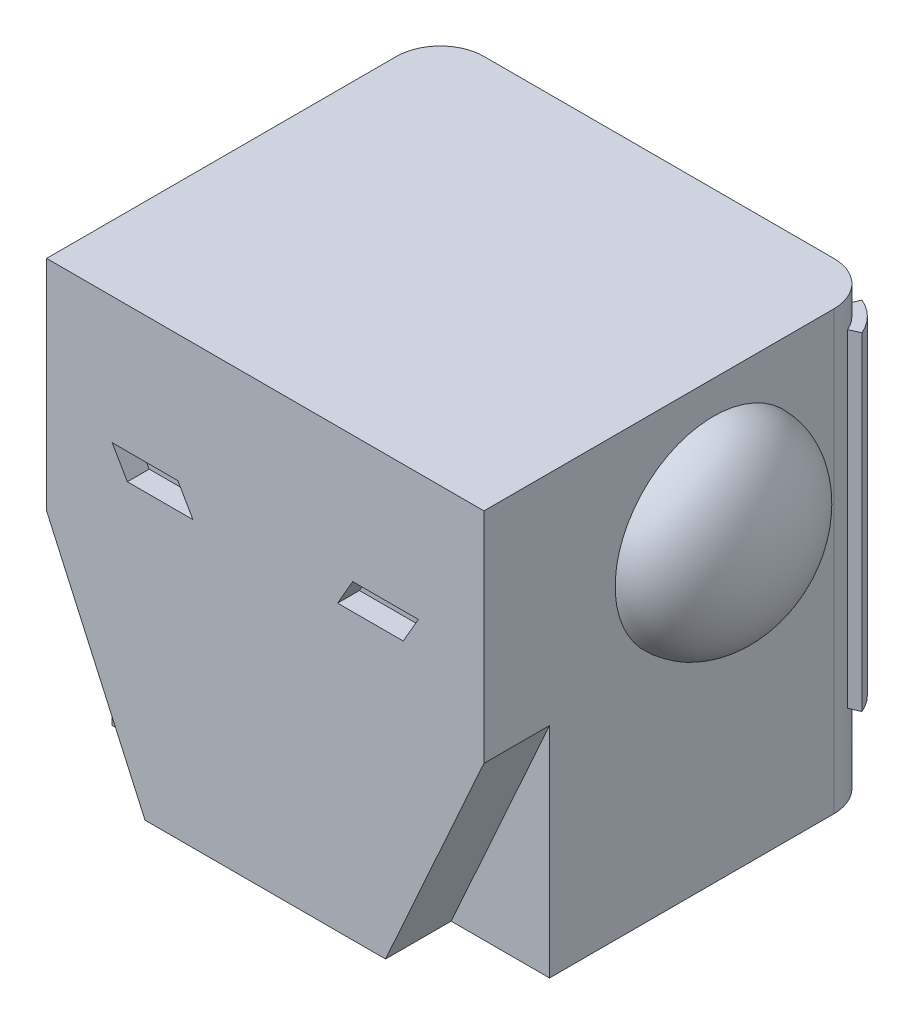
ISO-10303-21;
HEADER;
FILE_DESCRIPTION(('STEP AP214'),'2;1');
FILE_NAME('part.step','',(''),(''),'','','');
FILE_SCHEMA(('AUTOMOTIVE_DESIGN { 1 0 10303 214 1 1 1 1 }'));
ENDSEC;
DATA;
#1=APPLICATION_CONTEXT('core data for automotive mechanical design processes');
#2=APPLICATION_PROTOCOL_DEFINITION('international standard','automotive_design',2000,#1);
#3=PRODUCT_CONTEXT('',#1,'mechanical');
#4=PRODUCT('Part','Part','',(#3));
#5=PRODUCT_RELATED_PRODUCT_CATEGORY('part','',(#4));
#6=PRODUCT_DEFINITION_FORMATION('','',#4);
#7=PRODUCT_DEFINITION_CONTEXT('part definition',#1,'design');
#8=PRODUCT_DEFINITION('design','',#6,#7);
#9=PRODUCT_DEFINITION_SHAPE('','',#8);
#10=(LENGTH_UNIT() NAMED_UNIT(*) SI_UNIT(.MILLI.,.METRE.));
#11=(NAMED_UNIT(*) PLANE_ANGLE_UNIT() SI_UNIT($,.RADIAN.));
#12=(NAMED_UNIT(*) SI_UNIT($,.STERADIAN.) SOLID_ANGLE_UNIT());
#13=UNCERTAINTY_MEASURE_WITH_UNIT(LENGTH_MEASURE(1.E-05),#10,'distance_accuracy_value','');
#14=(GEOMETRIC_REPRESENTATION_CONTEXT(3) GLOBAL_UNCERTAINTY_ASSIGNED_CONTEXT((#13)) GLOBAL_UNIT_ASSIGNED_CONTEXT((#10,
#11,#12)) REPRESENTATION_CONTEXT('',''));
#15=CARTESIAN_POINT('',(0.,0.,0.));
#16=DIRECTION('',(0.,0.,1.));
#17=DIRECTION('',(1.,0.,0.));
#18=AXIS2_PLACEMENT_3D('',#15,#16,#17);
#19=CARTESIAN_POINT('',(10.,20.,-7.5));
#20=DIRECTION('',(1.,0.,0.));
#21=DIRECTION('',(0.,0.,-1.));
#22=AXIS2_PLACEMENT_3D('',#19,#20,#21);
#23=PLANE('',#22);
#24=DIRECTION('',(0.,0.,1.));
#25=VECTOR('',#24,1.);
#26=CARTESIAN_POINT('',(10.,0.,-7.5));
#27=LINE('',#26,#25);
#28=CARTESIAN_POINT('',(10.,0.,-5.5));
#29=VERTEX_POINT('',#28);
#30=CARTESIAN_POINT('',(10.,0.,7.5));
#31=VERTEX_POINT('',#30);
#32=EDGE_CURVE('E458',#29,#31,#27,.T.);
#33=ORIENTED_EDGE('',*,*,#32,.F.);
#34=DIRECTION('',(0.,-1.,0.));
#35=VECTOR('',#34,1.);
#36=CARTESIAN_POINT('',(10.,20.,-5.5));
#37=LINE('',#36,#35);
#38=CARTESIAN_POINT('',(10.,20.,-5.5));
#39=VERTEX_POINT('',#38);
#40=EDGE_CURVE('E12',#29,#39,#37,.F.);
#41=ORIENTED_EDGE('',*,*,#40,.T.);
#42=DIRECTION('',(0.,0.,1.));
#43=VECTOR('',#42,1.);
#44=CARTESIAN_POINT('',(10.,20.,-7.5));
#45=LINE('',#44,#43);
#46=CARTESIAN_POINT('',(10.,20.,10.5));
#47=VERTEX_POINT('',#46);
#48=EDGE_CURVE('E449',#39,#47,#45,.T.);
#49=ORIENTED_EDGE('',*,*,#48,.T.);
#50=DIRECTION('',(0.,1.,0.));
#51=VECTOR('',#50,1.);
#52=CARTESIAN_POINT('',(10.,10.,10.5));
#53=LINE('',#52,#51);
#54=CARTESIAN_POINT('',(10.,10.,10.5));
#55=VERTEX_POINT('',#54);
#56=EDGE_CURVE('E488',#55,#47,#53,.T.);
#57=ORIENTED_EDGE('',*,*,#56,.F.);
#58=DIRECTION('',(0.,0.,-1.));
#59=VECTOR('',#58,1.);
#60=CARTESIAN_POINT('',(10.,10.,10.5));
#61=LINE('',#60,#59);
#62=CARTESIAN_POINT('',(10.,9.99999999999998,7.5));
#63=VERTEX_POINT('',#62);
#64=EDGE_CURVE('E501',#55,#63,#61,.T.);
#65=ORIENTED_EDGE('',*,*,#64,.T.);
#66=DIRECTION('',(0.,-1.,0.));
#67=VECTOR('',#66,1.);
#68=CARTESIAN_POINT('',(10.,20.,7.5));
#69=LINE('',#68,#67);
#70=EDGE_CURVE('E469',#63,#31,#69,.T.);
#71=ORIENTED_EDGE('',*,*,#70,.T.);
#72=EDGE_LOOP('',(#33,#41,#49,#57,#65,#71));
#73=FACE_BOUND('',#72,.T.);
#74=CARTESIAN_POINT('',(10.,14.,0.));
#75=DIRECTION('',(1.,0.,0.));
#76=DIRECTION('',(0.,0.,-1.));
#77=AXIS2_PLACEMENT_3D('',#74,#75,#76);
#78=CIRCLE('',#77,4.5);
#79=CARTESIAN_POINT('',(10.,14.,-4.5));
#80=VERTEX_POINT('',#79);
#81=EDGE_CURVE('E313',#80,#80,#78,.F.);
#82=ORIENTED_EDGE('',*,*,#81,.T.);
#83=EDGE_LOOP('',(#82));
#84=FACE_BOUND('',#83,.T.);
#85=ADVANCED_FACE('F50',(#73,#84),#23,.T.);
#86=CARTESIAN_POINT('',(-10.,20.,-7.5));
#87=DIRECTION('',(1.,0.,0.));
#88=DIRECTION('',(0.,0.,-1.));
#89=AXIS2_PLACEMENT_3D('',#86,#87,#88);
#90=PLANE('',#89);
#91=DIRECTION('',(0.,0.,1.));
#92=VECTOR('',#91,1.);
#93=CARTESIAN_POINT('',(-10.,20.,-7.5));
#94=LINE('',#93,#92);
#95=CARTESIAN_POINT('',(-10.,20.,-5.5));
#96=VERTEX_POINT('',#95);
#97=CARTESIAN_POINT('',(-10.,20.,10.5));
#98=VERTEX_POINT('',#97);
#99=EDGE_CURVE('E437',#96,#98,#94,.T.);
#100=ORIENTED_EDGE('',*,*,#99,.F.);
#101=DIRECTION('',(0.,-1.,0.));
#102=VECTOR('',#101,1.);
#103=CARTESIAN_POINT('',(-10.,0.,-5.5));
#104=LINE('',#103,#102);
#105=CARTESIAN_POINT('',(-10.,0.,-5.5));
#106=VERTEX_POINT('',#105);
#107=EDGE_CURVE('E420',#96,#106,#104,.T.);
#108=ORIENTED_EDGE('',*,*,#107,.T.);
#109=DIRECTION('',(0.,0.,1.));
#110=VECTOR('',#109,1.);
#111=CARTESIAN_POINT('',(-10.,0.,-7.5));
#112=LINE('',#111,#110);
#113=CARTESIAN_POINT('',(-10.,0.,7.5));
#114=VERTEX_POINT('',#113);
#115=EDGE_CURVE('E456',#106,#114,#112,.T.);
#116=ORIENTED_EDGE('',*,*,#115,.T.);
#117=DIRECTION('',(0.,-1.,0.));
#118=VECTOR('',#117,1.);
#119=CARTESIAN_POINT('',(-10.,20.,7.5));
#120=LINE('',#119,#118);
#121=CARTESIAN_POINT('',(-10.,9.99999999999999,7.5));
#122=VERTEX_POINT('',#121);
#123=EDGE_CURVE('E473',#122,#114,#120,.T.);
#124=ORIENTED_EDGE('',*,*,#123,.F.);
#125=DIRECTION('',(0.,0.,-1.));
#126=VECTOR('',#125,1.);
#127=CARTESIAN_POINT('',(-10.,10.,10.5));
#128=LINE('',#127,#126);
#129=CARTESIAN_POINT('',(-10.,10.,10.5));
#130=VERTEX_POINT('',#129);
#131=EDGE_CURVE('E512',#130,#122,#128,.T.);
#132=ORIENTED_EDGE('',*,*,#131,.F.);
#133=DIRECTION('',(0.,-1.,0.));
#134=VECTOR('',#133,1.);
#135=CARTESIAN_POINT('',(-10.,20.,10.5));
#136=LINE('',#135,#134);
#137=EDGE_CURVE('E447',#98,#130,#136,.T.);
#138=ORIENTED_EDGE('',*,*,#137,.F.);
#139=EDGE_LOOP('',(#100,#108,#116,#124,#132,#138));
#140=FACE_BOUND('',#139,.T.);
#141=CARTESIAN_POINT('',(-10.,14.,0.));
#142=DIRECTION('',(1.,0.,0.));
#143=DIRECTION('',(0.,0.,-1.));
#144=AXIS2_PLACEMENT_3D('',#141,#142,#143);
#145=CIRCLE('',#144,4.5);
#146=CARTESIAN_POINT('',(-10.,14.,-4.5));
#147=VERTEX_POINT('',#146);
#148=EDGE_CURVE('E418',#147,#147,#145,.F.);
#149=ORIENTED_EDGE('',*,*,#148,.F.);
#150=EDGE_LOOP('',(#149));
#151=FACE_BOUND('',#150,.T.);
#152=ADVANCED_FACE('F372',(#140,#151),#90,.F.);
#153=CARTESIAN_POINT('',(0.,0.,10.5));
#154=DIRECTION('',(0.,0.,1.));
#155=DIRECTION('',(1.,0.,0.));
#156=AXIS2_PLACEMENT_3D('',#153,#154,#155);
#157=PLANE('',#156);
#158=DIRECTION('',(-1.,0.,0.));
#159=VECTOR('',#158,1.);
#160=CARTESIAN_POINT('',(10.,20.,10.5));
#161=LINE('',#160,#159);
#162=EDGE_CURVE('E498',#47,#98,#161,.T.);
#163=ORIENTED_EDGE('',*,*,#162,.T.);
#164=ORIENTED_EDGE('',*,*,#137,.T.);
#165=DIRECTION('',(0.410364677328798,-0.911921505175106,0.));
#166=VECTOR('',#165,1.);
#167=CARTESIAN_POINT('',(-10.,10.,10.5));
#168=LINE('',#167,#166);
#169=CARTESIAN_POINT('',(-5.5,0.,10.5));
#170=VERTEX_POINT('',#169);
#171=EDGE_CURVE('E539',#130,#170,#168,.T.);
#172=ORIENTED_EDGE('',*,*,#171,.T.);
#173=DIRECTION('',(1.,0.,0.));
#174=VECTOR('',#173,1.);
#175=CARTESIAN_POINT('',(-5.5,0.,10.5));
#176=LINE('',#175,#174);
#177=CARTESIAN_POINT('',(5.5,0.,10.5));
#178=VERTEX_POINT('',#177);
#179=EDGE_CURVE('E538',#170,#178,#176,.T.);
#180=ORIENTED_EDGE('',*,*,#179,.T.);
#181=DIRECTION('',(0.410364677328798,0.911921505175106,0.));
#182=VECTOR('',#181,1.);
#183=CARTESIAN_POINT('',(5.5,0.,10.5));
#184=LINE('',#183,#182);
#185=EDGE_CURVE('E537',#178,#55,#184,.T.);
#186=ORIENTED_EDGE('',*,*,#185,.T.);
#187=ORIENTED_EDGE('',*,*,#56,.T.);
#188=EDGE_LOOP('',(#163,#164,#172,#180,#186,#187));
#189=FACE_BOUND('',#188,.T.);
#190=DIRECTION('',(0.500000000000004,-0.866025403784436,0.));
#191=VECTOR('',#190,1.);
#192=CARTESIAN_POINT('',(-6.30717967697244,13.,10.5));
#193=LINE('',#192,#191);
#194=CARTESIAN_POINT('',(-7.,14.2,10.5));
#195=VERTEX_POINT('',#194);
#196=CARTESIAN_POINT('',(-6.30717967697244,13.,10.5));
#197=VERTEX_POINT('',#196);
#198=EDGE_CURVE('E564',#195,#197,#193,.T.);
#199=ORIENTED_EDGE('',*,*,#198,.F.);
#200=DIRECTION('',(-1.,0.,0.));
#201=VECTOR('',#200,1.);
#202=CARTESIAN_POINT('',(-7.,14.2,10.5));
#203=LINE('',#202,#201);
#204=CARTESIAN_POINT('',(-4.,14.2,10.5));
#205=VERTEX_POINT('',#204);
#206=EDGE_CURVE('E554',#205,#195,#203,.T.);
#207=ORIENTED_EDGE('',*,*,#206,.F.);
#208=DIRECTION('',(-0.500000000000004,0.866025403784436,0.));
#209=VECTOR('',#208,1.);
#210=CARTESIAN_POINT('',(-4.,14.2,10.5));
#211=LINE('',#210,#209);
#212=CARTESIAN_POINT('',(-3.30717967697244,13.,10.5));
#213=VERTEX_POINT('',#212);
#214=EDGE_CURVE('E558',#213,#205,#211,.T.);
#215=ORIENTED_EDGE('',*,*,#214,.F.);
#216=DIRECTION('',(1.,0.,0.));
#217=VECTOR('',#216,1.);
#218=CARTESIAN_POINT('',(-3.30717967697244,13.,10.5));
#219=LINE('',#218,#217);
#220=EDGE_CURVE('E561',#197,#213,#219,.T.);
#221=ORIENTED_EDGE('',*,*,#220,.F.);
#222=EDGE_LOOP('',(#199,#207,#215,#221));
#223=FACE_BOUND('',#222,.T.);
#224=DIRECTION('',(1.,0.,0.));
#225=VECTOR('',#224,1.);
#226=CARTESIAN_POINT('',(7.,14.2,10.5));
#227=LINE('',#226,#225);
#228=CARTESIAN_POINT('',(4.,14.2,10.5));
#229=VERTEX_POINT('',#228);
#230=CARTESIAN_POINT('',(7.,14.2,10.5));
#231=VERTEX_POINT('',#230);
#232=EDGE_CURVE('E594',#229,#231,#227,.T.);
#233=ORIENTED_EDGE('',*,*,#232,.T.);
#234=DIRECTION('',(-0.500000000000004,-0.866025403784436,0.));
#235=VECTOR('',#234,1.);
#236=CARTESIAN_POINT('',(6.30717967697244,13.,10.5));
#237=LINE('',#236,#235);
#238=CARTESIAN_POINT('',(6.30717967697244,13.,10.5));
#239=VERTEX_POINT('',#238);
#240=EDGE_CURVE('E597',#231,#239,#237,.T.);
#241=ORIENTED_EDGE('',*,*,#240,.T.);
#242=DIRECTION('',(-1.,0.,0.));
#243=VECTOR('',#242,1.);
#244=CARTESIAN_POINT('',(3.30717967697244,13.,10.5));
#245=LINE('',#244,#243);
#246=CARTESIAN_POINT('',(3.30717967697244,13.,10.5));
#247=VERTEX_POINT('',#246);
#248=EDGE_CURVE('E587',#239,#247,#245,.T.);
#249=ORIENTED_EDGE('',*,*,#248,.T.);
#250=DIRECTION('',(0.500000000000004,0.866025403784436,0.));
#251=VECTOR('',#250,1.);
#252=CARTESIAN_POINT('',(4.,14.2,10.5));
#253=LINE('',#252,#251);
#254=EDGE_CURVE('E591',#247,#229,#253,.T.);
#255=ORIENTED_EDGE('',*,*,#254,.T.);
#256=EDGE_LOOP('',(#233,#241,#249,#255));
#257=FACE_BOUND('',#256,.T.);
#258=ADVANCED_FACE('F368',(#189,#223,#257),#157,.T.);
#259=CARTESIAN_POINT('',(-10.,20.,7.5));
#260=DIRECTION('',(0.,0.,-1.));
#261=DIRECTION('',(-1.,0.,0.));
#262=AXIS2_PLACEMENT_3D('',#259,#260,#261);
#263=PLANE('',#262);
#264=DIRECTION('',(0.410364677328798,0.911921505175106,0.));
#265=VECTOR('',#264,1.);
#266=CARTESIAN_POINT('',(5.5,0.,7.5));
#267=LINE('',#266,#265);
#268=CARTESIAN_POINT('',(5.50000000000001,0.,7.5));
#269=VERTEX_POINT('',#268);
#270=EDGE_CURVE('E481',#269,#63,#267,.T.);
#271=ORIENTED_EDGE('',*,*,#270,.F.);
#272=DIRECTION('',(1.,0.,0.));
#273=VECTOR('',#272,1.);
#274=CARTESIAN_POINT('',(-10.,0.,7.5));
#275=LINE('',#274,#273);
#276=EDGE_CURVE('E474',#269,#31,#275,.T.);
#277=ORIENTED_EDGE('',*,*,#276,.T.);
#278=ORIENTED_EDGE('',*,*,#70,.F.);
#279=EDGE_LOOP('',(#271,#277,#278));
#280=FACE_BOUND('',#279,.T.);
#281=ADVANCED_FACE('F371',(#280),#263,.F.);
#282=DIRECTION('',(0.410364677328798,-0.911921505175106,0.));
#283=VECTOR('',#282,1.);
#284=CARTESIAN_POINT('',(-10.,10.,7.5));
#285=LINE('',#284,#283);
#286=CARTESIAN_POINT('',(-5.5,0.,7.5));
#287=VERTEX_POINT('',#286);
#288=EDGE_CURVE('E477',#122,#287,#285,.T.);
#289=ORIENTED_EDGE('',*,*,#288,.F.);
#290=ORIENTED_EDGE('',*,*,#123,.T.);
#291=EDGE_CURVE('E460',#114,#287,#275,.T.);
#292=ORIENTED_EDGE('',*,*,#291,.T.);
#293=EDGE_LOOP('',(#289,#290,#292));
#294=FACE_BOUND('',#293,.T.);
#295=ADVANCED_FACE('F407',(#294),#263,.F.);
#296=CARTESIAN_POINT('',(-10.,14.,0.));
#297=DIRECTION('',(0.,-1.,0.));
#298=DIRECTION('',(0.,0.,-1.));
#299=AXIS2_PLACEMENT_3D('',#296,#297,#298);
#300=ELLIPSE('',#299,4.5,3.);
#301=TRIMMED_CURVE('',#300,(PARAMETER_VALUE(4.71238898038469)),
(PARAMETER_VALUE(7.85398163397448)),.T.,.PARAMETER.);
#302=CARTESIAN_POINT('',(-7.,14.,0.));
#303=DIRECTION('',(-1.,0.,0.));
#304=AXIS1_PLACEMENT('',#302,#303);
#305=SURFACE_OF_REVOLUTION('',#301,#304);
#306=CARTESIAN_POINT('',(-13.,14.,0.));
#307=VERTEX_POINT('',#306);
#308=VERTEX_LOOP('',#307);
#309=FACE_BOUND('',#308,.T.);
#310=ORIENTED_EDGE('',*,*,#148,.T.);
#311=EDGE_LOOP('',(#310));
#312=FACE_BOUND('',#311,.T.);
#313=ADVANCED_FACE('F400',(#309,#312),#305,.F.);
#314=CARTESIAN_POINT('',(-10.,20.,-7.5));
#315=DIRECTION('',(0.,0.,-1.));
#316=DIRECTION('',(-1.,0.,0.));
#317=AXIS2_PLACEMENT_3D('',#314,#315,#316);
#318=PLANE('',#317);
#319=DIRECTION('',(1.,0.,0.));
#320=VECTOR('',#319,1.);
#321=CARTESIAN_POINT('',(-10.,0.,-7.5));
#322=LINE('',#321,#320);
#323=CARTESIAN_POINT('',(-8.,0.,-7.5));
#324=VERTEX_POINT('',#323);
#325=CARTESIAN_POINT('',(8.,0.,-7.5));
#326=VERTEX_POINT('',#325);
#327=EDGE_CURVE('E450',#324,#326,#322,.T.);
#328=ORIENTED_EDGE('',*,*,#327,.F.);
#329=DIRECTION('',(0.,-1.,0.));
#330=VECTOR('',#329,1.);
#331=CARTESIAN_POINT('',(-8.,20.,-7.5));
#332=LINE('',#331,#330);
#333=CARTESIAN_POINT('',(-8.,20.,-7.5));
#334=VERTEX_POINT('',#333);
#335=EDGE_CURVE('E430',#324,#334,#332,.F.);
#336=ORIENTED_EDGE('',*,*,#335,.T.);
#337=DIRECTION('',(1.,0.,0.));
#338=VECTOR('',#337,1.);
#339=CARTESIAN_POINT('',(-10.,20.,-7.5));
#340=LINE('',#339,#338);
#341=CARTESIAN_POINT('',(8.,20.,-7.5));
#342=VERTEX_POINT('',#341);
#343=EDGE_CURVE('E440',#334,#342,#340,.T.);
#344=ORIENTED_EDGE('',*,*,#343,.T.);
#345=DIRECTION('',(0.,-1.,0.));
#346=VECTOR('',#345,1.);
#347=CARTESIAN_POINT('',(8.,20.,-7.5));
#348=LINE('',#347,#346);
#349=EDGE_CURVE('E427',#342,#326,#348,.T.);
#350=ORIENTED_EDGE('',*,*,#349,.T.);
#351=EDGE_LOOP('',(#328,#336,#344,#350));
#352=FACE_BOUND('',#351,.T.);
#353=ADVANCED_FACE('F393',(#352),#318,.T.);
#354=CARTESIAN_POINT('',(0.,20.,0.));
#355=DIRECTION('',(0.,1.,0.));
#356=DIRECTION('',(0.,0.,1.));
#357=AXIS2_PLACEMENT_3D('',#354,#355,#356);
#358=PLANE('',#357);
#359=ORIENTED_EDGE('',*,*,#343,.F.);
#360=CARTESIAN_POINT('',(-8.,20.,-5.5));
#361=DIRECTION('',(0.,1.,0.));
#362=DIRECTION('',(0.,0.,1.));
#363=AXIS2_PLACEMENT_3D('',#360,#361,#362);
#364=CIRCLE('',#363,2.);
#365=EDGE_CURVE('E58',#334,#96,#364,.T.);
#366=ORIENTED_EDGE('',*,*,#365,.T.);
#367=ORIENTED_EDGE('',*,*,#99,.T.);
#368=ORIENTED_EDGE('',*,*,#162,.F.);
#369=ORIENTED_EDGE('',*,*,#48,.F.);
#370=CARTESIAN_POINT('',(8.,20.,-5.5));
#371=DIRECTION('',(0.,1.,0.));
#372=DIRECTION('',(0.,0.,1.));
#373=AXIS2_PLACEMENT_3D('',#370,#371,#372);
#374=CIRCLE('',#373,2.);
#375=EDGE_CURVE('E432',#39,#342,#374,.T.);
#376=ORIENTED_EDGE('',*,*,#375,.T.);
#377=EDGE_LOOP('',(#359,#366,#367,#368,#369,#376));
#378=FACE_BOUND('',#377,.T.);
#379=ADVANCED_FACE('F390',(#378),#358,.T.);
#380=CARTESIAN_POINT('',(0.,0.,0.));
#381=DIRECTION('',(0.,1.,0.));
#382=DIRECTION('',(0.,0.,1.));
#383=AXIS2_PLACEMENT_3D('',#380,#381,#382);
#384=PLANE('',#383);
#385=CARTESIAN_POINT('',(0.,0.,0.));
#386=DIRECTION('',(0.,-1.,0.));
#387=DIRECTION('',(0.,0.,-1.));
#388=AXIS2_PLACEMENT_3D('',#385,#386,#387);
#389=CIRCLE('',#388,4.5);
#390=CARTESIAN_POINT('',(0.,0.,-4.5));
#391=VERTEX_POINT('',#390);
#392=EDGE_CURVE('E516',#391,#391,#389,.T.);
#393=ORIENTED_EDGE('',*,*,#392,.F.);
#394=EDGE_LOOP('',(#393));
#395=FACE_BOUND('',#394,.T.);
#396=ORIENTED_EDGE('',*,*,#115,.F.);
#397=CARTESIAN_POINT('',(-8.,0.,-5.5));
#398=DIRECTION('',(0.,1.,0.));
#399=DIRECTION('',(0.,0.,1.));
#400=AXIS2_PLACEMENT_3D('',#397,#398,#399);
#401=CIRCLE('',#400,2.);
#402=EDGE_CURVE('E425',#106,#324,#401,.F.);
#403=ORIENTED_EDGE('',*,*,#402,.T.);
#404=ORIENTED_EDGE('',*,*,#327,.T.);
#405=CARTESIAN_POINT('',(8.,0.,-5.5));
#406=DIRECTION('',(0.,1.,0.));
#407=DIRECTION('',(0.,0.,1.));
#408=AXIS2_PLACEMENT_3D('',#405,#406,#407);
#409=CIRCLE('',#408,2.);
#410=EDGE_CURVE('E423',#326,#29,#409,.F.);
#411=ORIENTED_EDGE('',*,*,#410,.T.);
#412=ORIENTED_EDGE('',*,*,#32,.T.);
#413=ORIENTED_EDGE('',*,*,#276,.F.);
#414=DIRECTION('',(0.,0.,-1.));
#415=VECTOR('',#414,1.);
#416=CARTESIAN_POINT('',(5.5,0.,10.5));
#417=LINE('',#416,#415);
#418=EDGE_CURVE('E504',#178,#269,#417,.T.);
#419=ORIENTED_EDGE('',*,*,#418,.F.);
#420=ORIENTED_EDGE('',*,*,#179,.F.);
#421=DIRECTION('',(0.,0.,-1.));
#422=VECTOR('',#421,1.);
#423=CARTESIAN_POINT('',(-5.5,0.,10.5));
#424=LINE('',#423,#422);
#425=EDGE_CURVE('E483',#170,#287,#424,.T.);
#426=ORIENTED_EDGE('',*,*,#425,.T.);
#427=ORIENTED_EDGE('',*,*,#291,.F.);
#428=EDGE_LOOP('',(#396,#403,#404,#411,#412,#413,#419,#420,#426,#427));
#429=FACE_BOUND('',#428,.T.);
#430=ADVANCED_FACE('F388',(#395,#429),#384,.F.);
#431=CARTESIAN_POINT('',(0.,7.,0.));
#432=DIRECTION('',(0.,-1.,0.));
#433=DIRECTION('',(0.,0.,-1.));
#434=AXIS2_PLACEMENT_3D('',#431,#432,#433);
#435=CYLINDRICAL_SURFACE('',#434,4.5);
#436=CARTESIAN_POINT('',(0.,7.,0.));
#437=DIRECTION('',(0.,-1.,0.));
#438=DIRECTION('',(0.,0.,-1.));
#439=AXIS2_PLACEMENT_3D('',#436,#437,#438);
#440=CIRCLE('',#439,4.5);
#441=CARTESIAN_POINT('',(0.,7.,-4.5));
#442=VERTEX_POINT('',#441);
#443=EDGE_CURVE('E492',#442,#442,#440,.T.);
#444=ORIENTED_EDGE('',*,*,#443,.F.);
#445=EDGE_LOOP('',(#444));
#446=FACE_BOUND('',#445,.T.);
#447=ORIENTED_EDGE('',*,*,#392,.T.);
#448=EDGE_LOOP('',(#447));
#449=FACE_BOUND('',#448,.T.);
#450=ADVANCED_FACE('F384',(#446,#449),#435,.F.);
#451=CARTESIAN_POINT('',(0.,7.,0.));
#452=DIRECTION('',(0.,-1.,0.));
#453=DIRECTION('',(0.,0.,-1.));
#454=AXIS2_PLACEMENT_3D('',#451,#452,#453);
#455=PLANE('',#454);
#456=ORIENTED_EDGE('',*,*,#443,.T.);
#457=EDGE_LOOP('',(#456));
#458=FACE_BOUND('',#457,.T.);
#459=ADVANCED_FACE('F380',(#458),#455,.T.);
#460=CARTESIAN_POINT('',(-10.,10.,10.5));
#461=DIRECTION('',(0.911921505175106,0.410364677328798,0.));
#462=DIRECTION('',(-0.410364677328798,0.911921505175106,0.));
#463=AXIS2_PLACEMENT_3D('',#460,#461,#462);
#464=PLANE('',#463);
#465=ORIENTED_EDGE('',*,*,#288,.T.);
#466=ORIENTED_EDGE('',*,*,#425,.F.);
#467=ORIENTED_EDGE('',*,*,#171,.F.);
#468=ORIENTED_EDGE('',*,*,#131,.T.);
#469=EDGE_LOOP('',(#465,#466,#467,#468));
#470=FACE_BOUND('',#469,.T.);
#471=ADVANCED_FACE('F376',(#470),#464,.F.);
#472=CARTESIAN_POINT('',(5.5,0.,10.5));
#473=DIRECTION('',(-0.911921505175106,0.410364677328798,0.));
#474=DIRECTION('',(-0.410364677328798,-0.911921505175107,0.));
#475=AXIS2_PLACEMENT_3D('',#472,#473,#474);
#476=PLANE('',#475);
#477=ORIENTED_EDGE('',*,*,#270,.T.);
#478=ORIENTED_EDGE('',*,*,#64,.F.);
#479=ORIENTED_EDGE('',*,*,#185,.F.);
#480=ORIENTED_EDGE('',*,*,#418,.T.);
#481=EDGE_LOOP('',(#477,#478,#479,#480));
#482=FACE_BOUND('',#481,.T.);
#483=ADVANCED_FACE('F366',(#482),#476,.F.);
#484=CARTESIAN_POINT('',(-6.30717967697244,13.,9.5));
#485=DIRECTION('',(-0.866025403784436,-0.500000000000004,0.));
#486=DIRECTION('',(0.500000000000005,-0.866025403784436,0.));
#487=AXIS2_PLACEMENT_3D('',#484,#485,#486);
#488=PLANE('',#487);
#489=ORIENTED_EDGE('',*,*,#198,.T.);
#490=DIRECTION('',(0.,0.,1.));
#491=VECTOR('',#490,1.);
#492=CARTESIAN_POINT('',(-6.30717967697244,13.,9.5));
#493=LINE('',#492,#491);
#494=CARTESIAN_POINT('',(-6.30717967697244,13.,9.5));
#495=VERTEX_POINT('',#494);
#496=EDGE_CURVE('E545',#495,#197,#493,.T.);
#497=ORIENTED_EDGE('',*,*,#496,.F.);
#498=DIRECTION('',(0.500000000000004,-0.866025403784436,0.));
#499=VECTOR('',#498,1.);
#500=CARTESIAN_POINT('',(-6.30717967697244,13.,9.5));
#501=LINE('',#500,#499);
#502=CARTESIAN_POINT('',(-7.,14.2,9.5));
#503=VERTEX_POINT('',#502);
#504=EDGE_CURVE('E557',#503,#495,#501,.T.);
#505=ORIENTED_EDGE('',*,*,#504,.F.);
#506=DIRECTION('',(0.,0.,1.));
#507=VECTOR('',#506,1.);
#508=CARTESIAN_POINT('',(-7.,14.2,9.5));
#509=LINE('',#508,#507);
#510=EDGE_CURVE('E482',#503,#195,#509,.T.);
#511=ORIENTED_EDGE('',*,*,#510,.T.);
#512=EDGE_LOOP('',(#489,#497,#505,#511));
#513=FACE_BOUND('',#512,.T.);
#514=ADVANCED_FACE('F356',(#513),#488,.F.);
#515=CARTESIAN_POINT('',(-7.,14.2,9.5));
#516=DIRECTION('',(0.,1.,0.));
#517=DIRECTION('',(0.,0.,1.));
#518=AXIS2_PLACEMENT_3D('',#515,#516,#517);
#519=PLANE('',#518);
#520=ORIENTED_EDGE('',*,*,#206,.T.);
#521=ORIENTED_EDGE('',*,*,#510,.F.);
#522=DIRECTION('',(-1.,0.,0.));
#523=VECTOR('',#522,1.);
#524=CARTESIAN_POINT('',(-7.,14.2,9.5));
#525=LINE('',#524,#523);
#526=CARTESIAN_POINT('',(-4.,14.2,9.5));
#527=VERTEX_POINT('',#526);
#528=EDGE_CURVE('E549',#527,#503,#525,.T.);
#529=ORIENTED_EDGE('',*,*,#528,.F.);
#530=DIRECTION('',(0.,0.,1.));
#531=VECTOR('',#530,1.);
#532=CARTESIAN_POINT('',(-4.,14.2,9.5));
#533=LINE('',#532,#531);
#534=EDGE_CURVE('E551',#527,#205,#533,.T.);
#535=ORIENTED_EDGE('',*,*,#534,.T.);
#536=EDGE_LOOP('',(#520,#521,#529,#535));
#537=FACE_BOUND('',#536,.T.);
#538=ADVANCED_FACE('F352',(#537),#519,.F.);
#539=CARTESIAN_POINT('',(-4.,14.2,9.5));
#540=DIRECTION('',(0.866025403784436,0.500000000000004,0.));
#541=DIRECTION('',(-0.500000000000005,0.866025403784436,0.));
#542=AXIS2_PLACEMENT_3D('',#539,#540,#541);
#543=PLANE('',#542);
#544=ORIENTED_EDGE('',*,*,#214,.T.);
#545=ORIENTED_EDGE('',*,*,#534,.F.);
#546=DIRECTION('',(-0.500000000000004,0.866025403784436,0.));
#547=VECTOR('',#546,1.);
#548=CARTESIAN_POINT('',(-4.,14.2,9.5));
#549=LINE('',#548,#547);
#550=CARTESIAN_POINT('',(-3.30717967697244,13.,9.5));
#551=VERTEX_POINT('',#550);
#552=EDGE_CURVE('E569',#551,#527,#549,.T.);
#553=ORIENTED_EDGE('',*,*,#552,.F.);
#554=DIRECTION('',(0.,0.,1.));
#555=VECTOR('',#554,1.);
#556=CARTESIAN_POINT('',(-3.30717967697244,13.,9.5));
#557=LINE('',#556,#555);
#558=EDGE_CURVE('E548',#551,#213,#557,.T.);
#559=ORIENTED_EDGE('',*,*,#558,.T.);
#560=EDGE_LOOP('',(#544,#545,#553,#559));
#561=FACE_BOUND('',#560,.T.);
#562=ADVANCED_FACE('F355',(#561),#543,.F.);
#563=CARTESIAN_POINT('',(-3.30717967697244,13.,9.5));
#564=DIRECTION('',(0.,-1.,0.));
#565=DIRECTION('',(0.,0.,-1.));
#566=AXIS2_PLACEMENT_3D('',#563,#564,#565);
#567=PLANE('',#566);
#568=ORIENTED_EDGE('',*,*,#220,.T.);
#569=ORIENTED_EDGE('',*,*,#558,.F.);
#570=DIRECTION('',(1.,0.,0.));
#571=VECTOR('',#570,1.);
#572=CARTESIAN_POINT('',(-3.30717967697244,13.,9.5));
#573=LINE('',#572,#571);
#574=EDGE_CURVE('E572',#495,#551,#573,.T.);
#575=ORIENTED_EDGE('',*,*,#574,.F.);
#576=ORIENTED_EDGE('',*,*,#496,.T.);
#577=EDGE_LOOP('',(#568,#569,#575,#576));
#578=FACE_BOUND('',#577,.T.);
#579=ADVANCED_FACE('F350',(#578),#567,.F.);
#580=CARTESIAN_POINT('',(0.,0.,9.5));
#581=DIRECTION('',(0.,0.,-1.));
#582=DIRECTION('',(-1.,0.,0.));
#583=AXIS2_PLACEMENT_3D('',#580,#581,#582);
#584=PLANE('',#583);
#585=ORIENTED_EDGE('',*,*,#504,.T.);
#586=ORIENTED_EDGE('',*,*,#574,.T.);
#587=ORIENTED_EDGE('',*,*,#552,.T.);
#588=ORIENTED_EDGE('',*,*,#528,.T.);
#589=EDGE_LOOP('',(#585,#586,#587,#588));
#590=FACE_BOUND('',#589,.T.);
#591=ADVANCED_FACE('F346',(#590),#584,.F.);
#592=CARTESIAN_POINT('',(6.30717967697244,13.,9.5));
#593=DIRECTION('',(-0.866025403784436,0.500000000000004,0.));
#594=DIRECTION('',(-0.500000000000005,-0.866025403784436,0.));
#595=AXIS2_PLACEMENT_3D('',#592,#593,#594);
#596=PLANE('',#595);
#597=ORIENTED_EDGE('',*,*,#240,.F.);
#598=DIRECTION('',(0.,0.,1.));
#599=VECTOR('',#598,1.);
#600=CARTESIAN_POINT('',(7.,14.2,9.5));
#601=LINE('',#600,#599);
#602=CARTESIAN_POINT('',(7.,14.2,9.5));
#603=VERTEX_POINT('',#602);
#604=EDGE_CURVE('E577',#603,#231,#601,.T.);
#605=ORIENTED_EDGE('',*,*,#604,.F.);
#606=DIRECTION('',(-0.500000000000004,-0.866025403784436,0.));
#607=VECTOR('',#606,1.);
#608=CARTESIAN_POINT('',(6.30717967697244,13.,9.5));
#609=LINE('',#608,#607);
#610=CARTESIAN_POINT('',(6.30717967697244,13.,9.5));
#611=VERTEX_POINT('',#610);
#612=EDGE_CURVE('E590',#603,#611,#609,.T.);
#613=ORIENTED_EDGE('',*,*,#612,.T.);
#614=DIRECTION('',(0.,0.,1.));
#615=VECTOR('',#614,1.);
#616=CARTESIAN_POINT('',(6.30717967697244,13.,9.5));
#617=LINE('',#616,#615);
#618=EDGE_CURVE('E566',#611,#239,#617,.T.);
#619=ORIENTED_EDGE('',*,*,#618,.T.);
#620=EDGE_LOOP('',(#597,#605,#613,#619));
#621=FACE_BOUND('',#620,.T.);
#622=ADVANCED_FACE('F336',(#621),#596,.T.);
#623=CARTESIAN_POINT('',(3.30717967697244,13.,9.5));
#624=DIRECTION('',(0.,1.,0.));
#625=DIRECTION('',(0.,0.,1.));
#626=AXIS2_PLACEMENT_3D('',#623,#624,#625);
#627=PLANE('',#626);
#628=ORIENTED_EDGE('',*,*,#248,.F.);
#629=ORIENTED_EDGE('',*,*,#618,.F.);
#630=DIRECTION('',(-1.,0.,0.));
#631=VECTOR('',#630,1.);
#632=CARTESIAN_POINT('',(3.30717967697244,13.,9.5));
#633=LINE('',#632,#631);
#634=CARTESIAN_POINT('',(3.30717967697244,13.,9.5));
#635=VERTEX_POINT('',#634);
#636=EDGE_CURVE('E581',#611,#635,#633,.T.);
#637=ORIENTED_EDGE('',*,*,#636,.T.);
#638=DIRECTION('',(0.,0.,1.));
#639=VECTOR('',#638,1.);
#640=CARTESIAN_POINT('',(3.30717967697244,13.,9.5));
#641=LINE('',#640,#639);
#642=EDGE_CURVE('E583',#635,#247,#641,.T.);
#643=ORIENTED_EDGE('',*,*,#642,.T.);
#644=EDGE_LOOP('',(#628,#629,#637,#643));
#645=FACE_BOUND('',#644,.T.);
#646=ADVANCED_FACE('F332',(#645),#627,.T.);
#647=CARTESIAN_POINT('',(4.,14.2,9.5));
#648=DIRECTION('',(0.866025403784436,-0.500000000000004,0.));
#649=DIRECTION('',(0.500000000000005,0.866025403784436,0.));
#650=AXIS2_PLACEMENT_3D('',#647,#648,#649);
#651=PLANE('',#650);
#652=ORIENTED_EDGE('',*,*,#254,.F.);
#653=ORIENTED_EDGE('',*,*,#642,.F.);
#654=DIRECTION('',(0.500000000000004,0.866025403784436,0.));
#655=VECTOR('',#654,1.);
#656=CARTESIAN_POINT('',(4.,14.2,9.5));
#657=LINE('',#656,#655);
#658=CARTESIAN_POINT('',(4.,14.2,9.5));
#659=VERTEX_POINT('',#658);
#660=EDGE_CURVE('E601',#635,#659,#657,.T.);
#661=ORIENTED_EDGE('',*,*,#660,.T.);
#662=DIRECTION('',(0.,0.,1.));
#663=VECTOR('',#662,1.);
#664=CARTESIAN_POINT('',(4.,14.2,9.5));
#665=LINE('',#664,#663);
#666=EDGE_CURVE('E580',#659,#229,#665,.T.);
#667=ORIENTED_EDGE('',*,*,#666,.T.);
#668=EDGE_LOOP('',(#652,#653,#661,#667));
#669=FACE_BOUND('',#668,.T.);
#670=ADVANCED_FACE('F335',(#669),#651,.T.);
#671=CARTESIAN_POINT('',(7.,14.2,9.5));
#672=DIRECTION('',(0.,-1.,0.));
#673=DIRECTION('',(0.,0.,-1.));
#674=AXIS2_PLACEMENT_3D('',#671,#672,#673);
#675=PLANE('',#674);
#676=ORIENTED_EDGE('',*,*,#232,.F.);
#677=ORIENTED_EDGE('',*,*,#666,.F.);
#678=DIRECTION('',(1.,0.,0.));
#679=VECTOR('',#678,1.);
#680=CARTESIAN_POINT('',(7.,14.2,9.5));
#681=LINE('',#680,#679);
#682=EDGE_CURVE('E603',#659,#603,#681,.T.);
#683=ORIENTED_EDGE('',*,*,#682,.T.);
#684=ORIENTED_EDGE('',*,*,#604,.T.);
#685=EDGE_LOOP('',(#676,#677,#683,#684));
#686=FACE_BOUND('',#685,.T.);
#687=ADVANCED_FACE('F330',(#686),#675,.T.);
#688=CARTESIAN_POINT('',(0.,0.,9.5));
#689=DIRECTION('',(0.,0.,-1.));
#690=DIRECTION('',(1.,0.,0.));
#691=AXIS2_PLACEMENT_3D('',#688,#689,#690);
#692=PLANE('',#691);
#693=ORIENTED_EDGE('',*,*,#612,.F.);
#694=ORIENTED_EDGE('',*,*,#682,.F.);
#695=ORIENTED_EDGE('',*,*,#660,.F.);
#696=ORIENTED_EDGE('',*,*,#636,.F.);
#697=EDGE_LOOP('',(#693,#694,#695,#696));
#698=FACE_BOUND('',#697,.T.);
#699=ADVANCED_FACE('F324',(#698),#692,.F.);
#700=CARTESIAN_POINT('',(10.,14.,0.));
#701=DIRECTION('',(0.,1.,0.));
#702=DIRECTION('',(0.,0.,-1.));
#703=AXIS2_PLACEMENT_3D('',#700,#701,#702);
#704=ELLIPSE('',#703,4.5,3.);
#705=TRIMMED_CURVE('',#704,(PARAMETER_VALUE(4.71238898038469)),
(PARAMETER_VALUE(7.85398163397448)),.T.,.PARAMETER.);
#706=CARTESIAN_POINT('',(7.,14.,0.));
#707=DIRECTION('',(1.,0.,0.));
#708=AXIS1_PLACEMENT('',#706,#707);
#709=SURFACE_OF_REVOLUTION('',#705,#708);
#710=CARTESIAN_POINT('',(13.,14.,0.));
#711=VERTEX_POINT('',#710);
#712=VERTEX_LOOP('',#711);
#713=FACE_BOUND('',#712,.T.);
#714=ORIENTED_EDGE('',*,*,#81,.F.);
#715=EDGE_LOOP('',(#714));
#716=FACE_BOUND('',#715,.T.);
#717=ADVANCED_FACE('F319',(#713,#716),#709,.F.);
#718=CARTESIAN_POINT('',(-8.,20.,-5.5));
#719=DIRECTION('',(0.,1.,0.));
#720=DIRECTION('',(0.,0.,1.));
#721=AXIS2_PLACEMENT_3D('',#718,#719,#720);
#722=CYLINDRICAL_SURFACE('',#721,2.);
#723=DIRECTION('',(0.,1.,0.));
#724=VECTOR('',#723,1.);
#725=CARTESIAN_POINT('',(-8.79794892064175,3.7,-7.33392407695811));
#726=LINE('',#725,#724);
#727=CARTESIAN_POINT('',(-8.79794892064175,3.7,-7.33392407695811));
#728=VERTEX_POINT('',#727);
#729=CARTESIAN_POINT('',(-8.79794892064175,18.7,-7.33392407695811));
#730=VERTEX_POINT('',#729);
#731=EDGE_CURVE('E65',#728,#730,#726,.T.);
#732=ORIENTED_EDGE('',*,*,#731,.T.);
#733=CARTESIAN_POINT('',(-8.,18.7,-5.5));
#734=DIRECTION('',(0.,1.,0.));
#735=DIRECTION('',(-0.916962038479057,0.,-0.398974460320874));
#736=AXIS2_PLACEMENT_3D('',#733,#734,#735);
#737=CIRCLE('',#736,2.);
#738=CARTESIAN_POINT('',(-9.83392407695811,18.7,-6.29794892064175));
#739=VERTEX_POINT('',#738);
#740=EDGE_CURVE('E70',#730,#739,#737,.T.);
#741=ORIENTED_EDGE('',*,*,#740,.T.);
#742=DIRECTION('',(0.,-1.,0.));
#743=VECTOR('',#742,1.);
#744=CARTESIAN_POINT('',(-9.83392407695811,18.7,-6.29794892064175));
#745=LINE('',#744,#743);
#746=CARTESIAN_POINT('',(-9.83392407695812,3.7,-6.29794892064175));
#747=VERTEX_POINT('',#746);
#748=EDGE_CURVE('E265',#739,#747,#745,.T.);
#749=ORIENTED_EDGE('',*,*,#748,.T.);
#750=CARTESIAN_POINT('',(-8.,3.7,-5.5));
#751=DIRECTION('',(0.,1.,0.));
#752=DIRECTION('',(-0.916962038479057,0.,-0.398974460320873));
#753=AXIS2_PLACEMENT_3D('',#750,#751,#752);
#754=CIRCLE('',#753,2.);
#755=EDGE_CURVE('E243',#728,#747,#754,.T.);
#756=ORIENTED_EDGE('',*,*,#755,.F.);
#757=EDGE_LOOP('',(#732,#741,#749,#756));
#758=FACE_BOUND('',#757,.T.);
#759=ORIENTED_EDGE('',*,*,#365,.F.);
#760=ORIENTED_EDGE('',*,*,#335,.F.);
#761=ORIENTED_EDGE('',*,*,#402,.F.);
#762=ORIENTED_EDGE('',*,*,#107,.F.);
#763=EDGE_LOOP('',(#759,#760,#761,#762));
#764=FACE_BOUND('',#763,.T.);
#765=ADVANCED_FACE('F323',(#758,#764),#722,.T.);
#766=CARTESIAN_POINT('',(8.,20.,-5.5));
#767=DIRECTION('',(0.,-1.,0.));
#768=DIRECTION('',(0.,0.,-1.));
#769=AXIS2_PLACEMENT_3D('',#766,#767,#768);
#770=CYLINDRICAL_SURFACE('',#769,2.);
#771=DIRECTION('',(0.,1.,0.));
#772=VECTOR('',#771,1.);
#773=CARTESIAN_POINT('',(8.79794892064175,3.7,-7.33392407695811));
#774=LINE('',#773,#772);
#775=CARTESIAN_POINT('',(8.79794892064175,3.7,-7.33392407695811));
#776=VERTEX_POINT('',#775);
#777=CARTESIAN_POINT('',(8.79794892064175,18.7,-7.33392407695811));
#778=VERTEX_POINT('',#777);
#779=EDGE_CURVE('E297',#776,#778,#774,.T.);
#780=ORIENTED_EDGE('',*,*,#779,.F.);
#781=CARTESIAN_POINT('',(8.,3.7,-5.5));
#782=DIRECTION('',(0.,-1.,0.));
#783=DIRECTION('',(0.916962038479057,0.,-0.398974460320873));
#784=AXIS2_PLACEMENT_3D('',#781,#782,#783);
#785=CIRCLE('',#784,2.);
#786=CARTESIAN_POINT('',(9.83392407695812,3.7,-6.29794892064175));
#787=VERTEX_POINT('',#786);
#788=EDGE_CURVE('E301',#776,#787,#785,.T.);
#789=ORIENTED_EDGE('',*,*,#788,.T.);
#790=DIRECTION('',(0.,-1.,0.));
#791=VECTOR('',#790,1.);
#792=CARTESIAN_POINT('',(9.83392407695811,18.7,-6.29794892064175));
#793=LINE('',#792,#791);
#794=CARTESIAN_POINT('',(9.83392407695812,18.7,-6.29794892064175));
#795=VERTEX_POINT('',#794);
#796=EDGE_CURVE('E275',#795,#787,#793,.T.);
#797=ORIENTED_EDGE('',*,*,#796,.F.);
#798=CARTESIAN_POINT('',(8.,18.7,-5.5));
#799=DIRECTION('',(0.,-1.,0.));
#800=DIRECTION('',(0.916962038479057,0.,-0.398974460320874));
#801=AXIS2_PLACEMENT_3D('',#798,#799,#800);
#802=CIRCLE('',#801,2.);
#803=EDGE_CURVE('E281',#778,#795,#802,.T.);
#804=ORIENTED_EDGE('',*,*,#803,.F.);
#805=EDGE_LOOP('',(#780,#789,#797,#804));
#806=FACE_BOUND('',#805,.T.);
#807=ORIENTED_EDGE('',*,*,#375,.F.);
#808=ORIENTED_EDGE('',*,*,#40,.F.);
#809=ORIENTED_EDGE('',*,*,#410,.F.);
#810=ORIENTED_EDGE('',*,*,#349,.F.);
#811=EDGE_LOOP('',(#807,#808,#809,#810));
#812=FACE_BOUND('',#811,.T.);
#813=ADVANCED_FACE('F52',(#806,#812),#770,.T.);
#814=CARTESIAN_POINT('',(8.79794892064175,11.2,-7.33392407695811));
#815=DIRECTION('',(-0.916962038479057,0.,-0.398974460320874));
#816=DIRECTION('',(0.,1.,0.));
#817=AXIS2_PLACEMENT_3D('',#814,#815,#816);
#818=PLANE('',#817);
#819=DIRECTION('',(0.398974460320873,0.,-0.916962038479057));
#820=VECTOR('',#819,1.);
#821=CARTESIAN_POINT('',(8.79794892064175,3.7,-7.33392407695811));
#822=LINE('',#821,#820);
#823=CARTESIAN_POINT('',(8.99743615080218,3.7,-7.79240509619764));
#824=VERTEX_POINT('',#823);
#825=EDGE_CURVE('E311',#776,#824,#822,.T.);
#826=ORIENTED_EDGE('',*,*,#825,.F.);
#827=ORIENTED_EDGE('',*,*,#779,.T.);
#828=DIRECTION('',(0.398974460320874,0.,-0.916962038479057));
#829=VECTOR('',#828,1.);
#830=CARTESIAN_POINT('',(8.79794892064175,18.7,-7.33392407695811));
#831=LINE('',#830,#829);
#832=CARTESIAN_POINT('',(8.99743615080219,18.7,-7.79240509619764));
#833=VERTEX_POINT('',#832);
#834=EDGE_CURVE('E309',#778,#833,#831,.T.);
#835=ORIENTED_EDGE('',*,*,#834,.T.);
#836=DIRECTION('',(0.,-1.,0.));
#837=VECTOR('',#836,1.);
#838=CARTESIAN_POINT('',(8.99743615080219,20.,-7.79240509619764));
#839=LINE('',#838,#837);
#840=EDGE_CURVE('E287',#824,#833,#839,.F.);
#841=ORIENTED_EDGE('',*,*,#840,.F.);
#842=EDGE_LOOP('',(#826,#827,#835,#841));
#843=FACE_BOUND('',#842,.T.);
#844=ADVANCED_FACE('F666',(#843),#818,.T.);
#845=CARTESIAN_POINT('',(8.,18.7,-5.5));
#846=DIRECTION('',(0.,1.,0.));
#847=DIRECTION('',(0.,0.,1.));
#848=AXIS2_PLACEMENT_3D('',#845,#846,#847);
#849=PLANE('',#848);
#850=ORIENTED_EDGE('',*,*,#834,.F.);
#851=ORIENTED_EDGE('',*,*,#803,.T.);
#852=DIRECTION('',(0.916962038479057,0.,-0.398974460320874));
#853=VECTOR('',#852,1.);
#854=CARTESIAN_POINT('',(9.83392407695812,18.7,-6.29794892064175));
#855=LINE('',#854,#853);
#856=CARTESIAN_POINT('',(10.2924050961976,18.7,-6.49743615080219));
#857=VERTEX_POINT('',#856);
#858=EDGE_CURVE('E307',#795,#857,#855,.T.);
#859=ORIENTED_EDGE('',*,*,#858,.T.);
#860=CARTESIAN_POINT('',(8.,18.7,-5.5));
#861=DIRECTION('',(0.,-1.,0.));
#862=DIRECTION('',(0.,0.,-1.));
#863=AXIS2_PLACEMENT_3D('',#860,#861,#862);
#864=CIRCLE('',#863,2.5);
#865=EDGE_CURVE('E282',#833,#857,#864,.T.);
#866=ORIENTED_EDGE('',*,*,#865,.F.);
#867=EDGE_LOOP('',(#850,#851,#859,#866));
#868=FACE_BOUND('',#867,.T.);
#869=ADVANCED_FACE('F672',(#868),#849,.T.);
#870=CARTESIAN_POINT('',(9.83392407695811,11.2,-6.29794892064175));
#871=DIRECTION('',(0.398974460320874,0.,0.916962038479057));
#872=DIRECTION('',(0.,-1.,0.));
#873=AXIS2_PLACEMENT_3D('',#870,#871,#872);
#874=PLANE('',#873);
#875=ORIENTED_EDGE('',*,*,#858,.F.);
#876=ORIENTED_EDGE('',*,*,#796,.T.);
#877=DIRECTION('',(0.916962038479057,0.,-0.398974460320873));
#878=VECTOR('',#877,1.);
#879=CARTESIAN_POINT('',(9.83392407695812,3.7,-6.29794892064175));
#880=LINE('',#879,#878);
#881=CARTESIAN_POINT('',(10.2924050961976,3.7,-6.49743615080218));
#882=VERTEX_POINT('',#881);
#883=EDGE_CURVE('E286',#787,#882,#880,.T.);
#884=ORIENTED_EDGE('',*,*,#883,.T.);
#885=DIRECTION('',(0.,-1.,0.));
#886=VECTOR('',#885,1.);
#887=CARTESIAN_POINT('',(10.2924050961976,20.,-6.49743615080218));
#888=LINE('',#887,#886);
#889=EDGE_CURVE('E276',#857,#882,#888,.T.);
#890=ORIENTED_EDGE('',*,*,#889,.F.);
#891=EDGE_LOOP('',(#875,#876,#884,#890));
#892=FACE_BOUND('',#891,.T.);
#893=ADVANCED_FACE('F684',(#892),#874,.T.);
#894=CARTESIAN_POINT('',(8.,3.7,-5.5));
#895=DIRECTION('',(0.,1.,0.));
#896=DIRECTION('',(0.,0.,1.));
#897=AXIS2_PLACEMENT_3D('',#894,#895,#896);
#898=PLANE('',#897);
#899=ORIENTED_EDGE('',*,*,#788,.F.);
#900=ORIENTED_EDGE('',*,*,#825,.T.);
#901=CARTESIAN_POINT('',(8.,3.7,-5.5));
#902=DIRECTION('',(0.,-1.,0.));
#903=DIRECTION('',(0.,0.,-1.));
#904=AXIS2_PLACEMENT_3D('',#901,#902,#903);
#905=CIRCLE('',#904,2.5);
#906=EDGE_CURVE('E280',#824,#882,#905,.T.);
#907=ORIENTED_EDGE('',*,*,#906,.T.);
#908=ORIENTED_EDGE('',*,*,#883,.F.);
#909=EDGE_LOOP('',(#899,#900,#907,#908));
#910=FACE_BOUND('',#909,.T.);
#911=ADVANCED_FACE('F326',(#910),#898,.F.);
#912=CARTESIAN_POINT('',(8.,20.,-5.5));
#913=DIRECTION('',(0.,-1.,0.));
#914=DIRECTION('',(0.,0.,-1.));
#915=AXIS2_PLACEMENT_3D('',#912,#913,#914);
#916=CYLINDRICAL_SURFACE('',#915,2.5);
#917=ORIENTED_EDGE('',*,*,#889,.T.);
#918=ORIENTED_EDGE('',*,*,#906,.F.);
#919=ORIENTED_EDGE('',*,*,#840,.T.);
#920=ORIENTED_EDGE('',*,*,#865,.T.);
#921=EDGE_LOOP('',(#917,#918,#919,#920));
#922=FACE_BOUND('',#921,.T.);
#923=ADVANCED_FACE('F688',(#922),#916,.T.);
#924=CARTESIAN_POINT('',(-8.79794892064175,11.2,-7.33392407695811));
#925=DIRECTION('',(0.916962038479057,0.,-0.398974460320874));
#926=DIRECTION('',(0.,1.,0.));
#927=AXIS2_PLACEMENT_3D('',#924,#925,#926);
#928=PLANE('',#927);
#929=DIRECTION('',(-0.398974460320873,0.,-0.916962038479057));
#930=VECTOR('',#929,1.);
#931=CARTESIAN_POINT('',(-8.79794892064175,3.7,-7.33392407695811));
#932=LINE('',#931,#930);
#933=CARTESIAN_POINT('',(-8.99743615080218,3.7,-7.79240509619764));
#934=VERTEX_POINT('',#933);
#935=EDGE_CURVE('E247',#728,#934,#932,.T.);
#936=ORIENTED_EDGE('',*,*,#935,.T.);
#937=DIRECTION('',(0.,-1.,0.));
#938=VECTOR('',#937,1.);
#939=CARTESIAN_POINT('',(-8.99743615080219,20.,-7.79240509619764));
#940=LINE('',#939,#938);
#941=CARTESIAN_POINT('',(-8.99743615080219,18.7,-7.79240509619764));
#942=VERTEX_POINT('',#941);
#943=EDGE_CURVE('E233',#934,#942,#940,.F.);
#944=ORIENTED_EDGE('',*,*,#943,.T.);
#945=DIRECTION('',(-0.398974460320874,0.,-0.916962038479057));
#946=VECTOR('',#945,1.);
#947=CARTESIAN_POINT('',(-8.79794892064175,18.7,-7.33392407695811));
#948=LINE('',#947,#946);
#949=EDGE_CURVE('E268',#730,#942,#948,.T.);
#950=ORIENTED_EDGE('',*,*,#949,.F.);
#951=ORIENTED_EDGE('',*,*,#731,.F.);
#952=EDGE_LOOP('',(#936,#944,#950,#951));
#953=FACE_BOUND('',#952,.T.);
#954=ADVANCED_FACE('F690',(#953),#928,.T.);
#955=CARTESIAN_POINT('',(-8.,18.7,-5.5));
#956=DIRECTION('',(0.,1.,0.));
#957=DIRECTION('',(0.,0.,1.));
#958=AXIS2_PLACEMENT_3D('',#955,#956,#957);
#959=PLANE('',#958);
#960=ORIENTED_EDGE('',*,*,#949,.T.);
#961=CARTESIAN_POINT('',(-8.,18.7,-5.5));
#962=DIRECTION('',(0.,1.,0.));
#963=DIRECTION('',(0.,0.,-1.));
#964=AXIS2_PLACEMENT_3D('',#961,#962,#963);
#965=CIRCLE('',#964,2.5);
#966=CARTESIAN_POINT('',(-10.2924050961976,18.7,-6.49743615080219));
#967=VERTEX_POINT('',#966);
#968=EDGE_CURVE('E261',#942,#967,#965,.T.);
#969=ORIENTED_EDGE('',*,*,#968,.T.);
#970=DIRECTION('',(-0.916962038479057,0.,-0.398974460320874));
#971=VECTOR('',#970,1.);
#972=CARTESIAN_POINT('',(-9.83392407695812,18.7,-6.29794892064175));
#973=LINE('',#972,#971);
#974=EDGE_CURVE('E246',#739,#967,#973,.T.);
#975=ORIENTED_EDGE('',*,*,#974,.F.);
#976=ORIENTED_EDGE('',*,*,#740,.F.);
#977=EDGE_LOOP('',(#960,#969,#975,#976));
#978=FACE_BOUND('',#977,.T.);
#979=ADVANCED_FACE('F696',(#978),#959,.T.);
#980=CARTESIAN_POINT('',(-9.83392407695811,11.2,-6.29794892064175));
#981=DIRECTION('',(-0.398974460320874,0.,0.916962038479057));
#982=DIRECTION('',(0.,-1.,0.));
#983=AXIS2_PLACEMENT_3D('',#980,#981,#982);
#984=PLANE('',#983);
#985=ORIENTED_EDGE('',*,*,#974,.T.);
#986=DIRECTION('',(0.,-1.,0.));
#987=VECTOR('',#986,1.);
#988=CARTESIAN_POINT('',(-10.2924050961976,20.,-6.49743615080218));
#989=LINE('',#988,#987);
#990=CARTESIAN_POINT('',(-10.2924050961976,3.7,-6.49743615080218));
#991=VERTEX_POINT('',#990);
#992=EDGE_CURVE('E230',#967,#991,#989,.T.);
#993=ORIENTED_EDGE('',*,*,#992,.T.);
#994=DIRECTION('',(-0.916962038479057,0.,-0.398974460320873));
#995=VECTOR('',#994,1.);
#996=CARTESIAN_POINT('',(-9.83392407695812,3.7,-6.29794892064175));
#997=LINE('',#996,#995);
#998=EDGE_CURVE('E241',#747,#991,#997,.T.);
#999=ORIENTED_EDGE('',*,*,#998,.F.);
#1000=ORIENTED_EDGE('',*,*,#748,.F.);
#1001=EDGE_LOOP('',(#985,#993,#999,#1000));
#1002=FACE_BOUND('',#1001,.T.);
#1003=ADVANCED_FACE('F249',(#1002),#984,.T.);
#1004=CARTESIAN_POINT('',(-8.,3.7,-5.5));
#1005=DIRECTION('',(0.,1.,0.));
#1006=DIRECTION('',(0.,0.,1.));
#1007=AXIS2_PLACEMENT_3D('',#1004,#1005,#1006);
#1008=PLANE('',#1007);
#1009=ORIENTED_EDGE('',*,*,#755,.T.);
#1010=ORIENTED_EDGE('',*,*,#998,.T.);
#1011=CARTESIAN_POINT('',(-8.,3.7,-5.5));
#1012=DIRECTION('',(0.,1.,0.));
#1013=DIRECTION('',(0.,0.,-1.));
#1014=AXIS2_PLACEMENT_3D('',#1011,#1012,#1013);
#1015=CIRCLE('',#1014,2.5);
#1016=EDGE_CURVE('E226',#934,#991,#1015,.T.);
#1017=ORIENTED_EDGE('',*,*,#1016,.F.);
#1018=ORIENTED_EDGE('',*,*,#935,.F.);
#1019=EDGE_LOOP('',(#1009,#1010,#1017,#1018));
#1020=FACE_BOUND('',#1019,.T.);
#1021=ADVANCED_FACE('F242',(#1020),#1008,.F.);
#1022=CARTESIAN_POINT('',(-8.,20.,-5.5));
#1023=DIRECTION('',(0.,-1.,0.));
#1024=DIRECTION('',(0.,0.,-1.));
#1025=AXIS2_PLACEMENT_3D('',#1022,#1023,#1024);
#1026=CYLINDRICAL_SURFACE('',#1025,2.5);
#1027=ORIENTED_EDGE('',*,*,#992,.F.);
#1028=ORIENTED_EDGE('',*,*,#968,.F.);
#1029=ORIENTED_EDGE('',*,*,#943,.F.);
#1030=ORIENTED_EDGE('',*,*,#1016,.T.);
#1031=EDGE_LOOP('',(#1027,#1028,#1029,#1030));
#1032=FACE_BOUND('',#1031,.T.);
#1033=ADVANCED_FACE('F228',(#1032),#1026,.T.);
#1034=CLOSED_SHELL('',(#85,#152,#258,#281,#295,#313,#353,#379,#430,#450,#459,#471,#483,#514,
#538,#562,#579,#591,#622,#646,#670,#687,#699,#717,#765,#813,#844,#869,#893,#911,#923,#954,#979,
#1003,#1021,#1033));
#1035=MANIFOLD_SOLID_BREP('B2',#1034);
#1036=ADVANCED_BREP_SHAPE_REPRESENTATION('',(#18,#1035),#14);
#1037=SHAPE_DEFINITION_REPRESENTATION(#9,#1036);
ENDSEC;
END-ISO-10303-21;
